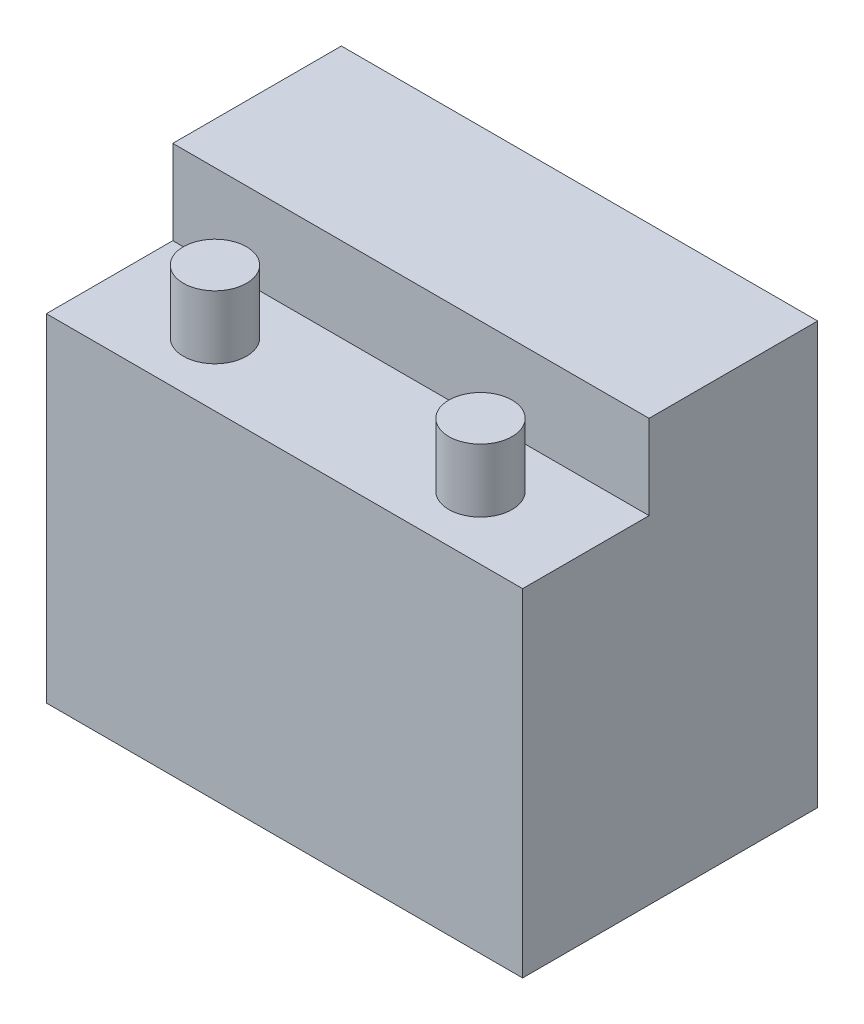
ISO-10303-21;
HEADER;
FILE_DESCRIPTION(('STEP AP214'),'2;1');
FILE_NAME('part.step','',(''),(''),'','','');
FILE_SCHEMA(('AUTOMOTIVE_DESIGN { 1 0 10303 214 1 1 1 1 }'));
ENDSEC;
DATA;
#1=APPLICATION_CONTEXT('core data for automotive mechanical design processes');
#2=APPLICATION_PROTOCOL_DEFINITION('international standard','automotive_design',2000,#1);
#3=PRODUCT_CONTEXT('',#1,'mechanical');
#4=PRODUCT('Part','Part','',(#3));
#5=PRODUCT_RELATED_PRODUCT_CATEGORY('part','',(#4));
#6=PRODUCT_DEFINITION_FORMATION('','',#4);
#7=PRODUCT_DEFINITION_CONTEXT('part definition',#1,'design');
#8=PRODUCT_DEFINITION('design','',#6,#7);
#9=PRODUCT_DEFINITION_SHAPE('','',#8);
#10=(LENGTH_UNIT() NAMED_UNIT(*) SI_UNIT(.MILLI.,.METRE.));
#11=(NAMED_UNIT(*) PLANE_ANGLE_UNIT() SI_UNIT($,.RADIAN.));
#12=(NAMED_UNIT(*) SI_UNIT($,.STERADIAN.) SOLID_ANGLE_UNIT());
#13=UNCERTAINTY_MEASURE_WITH_UNIT(LENGTH_MEASURE(1.E-05),#10,'distance_accuracy_value','');
#14=(GEOMETRIC_REPRESENTATION_CONTEXT(3) GLOBAL_UNCERTAINTY_ASSIGNED_CONTEXT((#13)) GLOBAL_UNIT_ASSIGNED_CONTEXT((#10,
#11,#12)) REPRESENTATION_CONTEXT('',''));
#15=CARTESIAN_POINT('',(0.,0.,0.));
#16=DIRECTION('',(0.,0.,1.));
#17=DIRECTION('',(1.,0.,0.));
#18=AXIS2_PLACEMENT_3D('',#15,#16,#17);
#19=CARTESIAN_POINT('',(-56.5,100.,35.));
#20=DIRECTION('',(0.,0.,-1.));
#21=DIRECTION('',(-1.,0.,0.));
#22=AXIS2_PLACEMENT_3D('',#19,#20,#21);
#23=PLANE('',#22);
#24=DIRECTION('',(1.,0.,0.));
#25=VECTOR('',#24,1.);
#26=CARTESIAN_POINT('',(56.5,80.,35.));
#27=LINE('',#26,#25);
#28=CARTESIAN_POINT('',(-56.5,80.,35.));
#29=VERTEX_POINT('',#28);
#30=CARTESIAN_POINT('',(56.5,80.,35.));
#31=VERTEX_POINT('',#30);
#32=EDGE_CURVE('E119',#29,#31,#27,.T.);
#33=ORIENTED_EDGE('',*,*,#32,.F.);
#34=DIRECTION('',(0.,-1.,0.));
#35=VECTOR('',#34,1.);
#36=CARTESIAN_POINT('',(-56.5,100.,35.));
#37=LINE('',#36,#35);
#38=CARTESIAN_POINT('',(-56.5,0.,35.));
#39=VERTEX_POINT('',#38);
#40=EDGE_CURVE('E86',#29,#39,#37,.T.);
#41=ORIENTED_EDGE('',*,*,#40,.T.);
#42=DIRECTION('',(1.,0.,0.));
#43=VECTOR('',#42,1.);
#44=CARTESIAN_POINT('',(-56.5,0.,35.));
#45=LINE('',#44,#43);
#46=CARTESIAN_POINT('',(56.5,0.,35.));
#47=VERTEX_POINT('',#46);
#48=EDGE_CURVE('E90',#39,#47,#45,.T.);
#49=ORIENTED_EDGE('',*,*,#48,.T.);
#50=DIRECTION('',(0.,-1.,0.));
#51=VECTOR('',#50,1.);
#52=CARTESIAN_POINT('',(56.5,100.,35.));
#53=LINE('',#52,#51);
#54=EDGE_CURVE('E76',#31,#47,#53,.T.);
#55=ORIENTED_EDGE('',*,*,#54,.F.);
#56=EDGE_LOOP('',(#33,#41,#49,#55));
#57=FACE_BOUND('',#56,.T.);
#58=ADVANCED_FACE('F32',(#57),#23,.F.);
#59=CARTESIAN_POINT('',(56.5,100.,35.));
#60=DIRECTION('',(-1.,0.,0.));
#61=DIRECTION('',(0.,0.,1.));
#62=AXIS2_PLACEMENT_3D('',#59,#60,#61);
#63=PLANE('',#62);
#64=DIRECTION('',(0.,0.,-1.));
#65=VECTOR('',#64,1.);
#66=CARTESIAN_POINT('',(56.5,100.,35.));
#67=LINE('',#66,#65);
#68=CARTESIAN_POINT('',(56.5,100.,5.00000000000001));
#69=VERTEX_POINT('',#68);
#70=CARTESIAN_POINT('',(56.5,100.,-35.));
#71=VERTEX_POINT('',#70);
#72=EDGE_CURVE('E95',#69,#71,#67,.T.);
#73=ORIENTED_EDGE('',*,*,#72,.F.);
#74=DIRECTION('',(0.,1.,0.));
#75=VECTOR('',#74,1.);
#76=CARTESIAN_POINT('',(56.5,80.,5.));
#77=LINE('',#76,#75);
#78=CARTESIAN_POINT('',(56.5,80.,5.));
#79=VERTEX_POINT('',#78);
#80=EDGE_CURVE('E47',#79,#69,#77,.T.);
#81=ORIENTED_EDGE('',*,*,#80,.F.);
#82=DIRECTION('',(0.,0.,-1.));
#83=VECTOR('',#82,1.);
#84=CARTESIAN_POINT('',(56.5,80.,35.));
#85=LINE('',#84,#83);
#86=EDGE_CURVE('E83',#31,#79,#85,.T.);
#87=ORIENTED_EDGE('',*,*,#86,.F.);
#88=ORIENTED_EDGE('',*,*,#54,.T.);
#89=DIRECTION('',(0.,0.,-1.));
#90=VECTOR('',#89,1.);
#91=CARTESIAN_POINT('',(56.5,0.,35.));
#92=LINE('',#91,#90);
#93=CARTESIAN_POINT('',(56.5,0.,-35.));
#94=VERTEX_POINT('',#93);
#95=EDGE_CURVE('E81',#47,#94,#92,.T.);
#96=ORIENTED_EDGE('',*,*,#95,.T.);
#97=DIRECTION('',(0.,-1.,0.));
#98=VECTOR('',#97,1.);
#99=CARTESIAN_POINT('',(56.5,100.,-35.));
#100=LINE('',#99,#98);
#101=EDGE_CURVE('E11',#71,#94,#100,.T.);
#102=ORIENTED_EDGE('',*,*,#101,.F.);
#103=EDGE_LOOP('',(#73,#81,#87,#88,#96,#102));
#104=FACE_BOUND('',#103,.T.);
#105=ADVANCED_FACE('F34',(#104),#63,.F.);
#106=CARTESIAN_POINT('',(-56.5,100.,-35.));
#107=DIRECTION('',(0.,0.,1.));
#108=DIRECTION('',(1.,0.,0.));
#109=AXIS2_PLACEMENT_3D('',#106,#107,#108);
#110=PLANE('',#109);
#111=DIRECTION('',(-1.,0.,0.));
#112=VECTOR('',#111,1.);
#113=CARTESIAN_POINT('',(-56.5,0.,-35.));
#114=LINE('',#113,#112);
#115=CARTESIAN_POINT('',(-56.5,0.,-35.));
#116=VERTEX_POINT('',#115);
#117=EDGE_CURVE('E99',#94,#116,#114,.T.);
#118=ORIENTED_EDGE('',*,*,#117,.T.);
#119=DIRECTION('',(0.,-1.,0.));
#120=VECTOR('',#119,1.);
#121=CARTESIAN_POINT('',(-56.5,100.,-35.));
#122=LINE('',#121,#120);
#123=CARTESIAN_POINT('',(-56.5,100.,-35.));
#124=VERTEX_POINT('',#123);
#125=EDGE_CURVE('E40',#124,#116,#122,.T.);
#126=ORIENTED_EDGE('',*,*,#125,.F.);
#127=DIRECTION('',(-1.,0.,0.));
#128=VECTOR('',#127,1.);
#129=CARTESIAN_POINT('',(-56.5,100.,-35.));
#130=LINE('',#129,#128);
#131=EDGE_CURVE('E56',#71,#124,#130,.T.);
#132=ORIENTED_EDGE('',*,*,#131,.F.);
#133=ORIENTED_EDGE('',*,*,#101,.T.);
#134=EDGE_LOOP('',(#118,#126,#132,#133));
#135=FACE_BOUND('',#134,.T.);
#136=ADVANCED_FACE('F115',(#135),#110,.F.);
#137=CARTESIAN_POINT('',(-56.5,100.,35.));
#138=DIRECTION('',(1.,0.,0.));
#139=DIRECTION('',(0.,0.,-1.));
#140=AXIS2_PLACEMENT_3D('',#137,#138,#139);
#141=PLANE('',#140);
#142=DIRECTION('',(0.,0.,1.));
#143=VECTOR('',#142,1.);
#144=CARTESIAN_POINT('',(-56.5,80.,35.));
#145=LINE('',#144,#143);
#146=CARTESIAN_POINT('',(-56.5,80.,5.00000000000002));
#147=VERTEX_POINT('',#146);
#148=EDGE_CURVE('E126',#147,#29,#145,.T.);
#149=ORIENTED_EDGE('',*,*,#148,.F.);
#150=DIRECTION('',(0.,1.,0.));
#151=VECTOR('',#150,1.);
#152=CARTESIAN_POINT('',(-56.5,80.,5.00000000000002));
#153=LINE('',#152,#151);
#154=CARTESIAN_POINT('',(-56.5,100.,5.00000000000002));
#155=VERTEX_POINT('',#154);
#156=EDGE_CURVE('E100',#147,#155,#153,.T.);
#157=ORIENTED_EDGE('',*,*,#156,.T.);
#158=DIRECTION('',(0.,0.,1.));
#159=VECTOR('',#158,1.);
#160=CARTESIAN_POINT('',(-56.5,100.,35.));
#161=LINE('',#160,#159);
#162=EDGE_CURVE('E87',#124,#155,#161,.T.);
#163=ORIENTED_EDGE('',*,*,#162,.F.);
#164=ORIENTED_EDGE('',*,*,#125,.T.);
#165=DIRECTION('',(0.,0.,1.));
#166=VECTOR('',#165,1.);
#167=CARTESIAN_POINT('',(-56.5,0.,35.));
#168=LINE('',#167,#166);
#169=EDGE_CURVE('E96',#116,#39,#168,.T.);
#170=ORIENTED_EDGE('',*,*,#169,.T.);
#171=ORIENTED_EDGE('',*,*,#40,.F.);
#172=EDGE_LOOP('',(#149,#157,#163,#164,#170,#171));
#173=FACE_BOUND('',#172,.T.);
#174=ADVANCED_FACE('F113',(#173),#141,.F.);
#175=CARTESIAN_POINT('',(0.,100.,0.));
#176=DIRECTION('',(0.,-1.,0.));
#177=DIRECTION('',(0.,0.,-1.));
#178=AXIS2_PLACEMENT_3D('',#175,#176,#177);
#179=PLANE('',#178);
#180=ORIENTED_EDGE('',*,*,#162,.T.);
#181=DIRECTION('',(-1.,0.,0.));
#182=VECTOR('',#181,1.);
#183=CARTESIAN_POINT('',(56.5,100.,5.));
#184=LINE('',#183,#182);
#185=EDGE_CURVE('E121',#69,#155,#184,.T.);
#186=ORIENTED_EDGE('',*,*,#185,.F.);
#187=ORIENTED_EDGE('',*,*,#72,.T.);
#188=ORIENTED_EDGE('',*,*,#131,.T.);
#189=EDGE_LOOP('',(#180,#186,#187,#188));
#190=FACE_BOUND('',#189,.T.);
#191=ADVANCED_FACE('F170',(#190),#179,.F.);
#192=CARTESIAN_POINT('',(0.,0.,0.));
#193=DIRECTION('',(0.,-1.,0.));
#194=DIRECTION('',(0.,0.,-1.));
#195=AXIS2_PLACEMENT_3D('',#192,#193,#194);
#196=PLANE('',#195);
#197=ORIENTED_EDGE('',*,*,#95,.F.);
#198=ORIENTED_EDGE('',*,*,#48,.F.);
#199=ORIENTED_EDGE('',*,*,#169,.F.);
#200=ORIENTED_EDGE('',*,*,#117,.F.);
#201=EDGE_LOOP('',(#197,#198,#199,#200));
#202=FACE_BOUND('',#201,.T.);
#203=ADVANCED_FACE('F98',(#202),#196,.T.);
#204=CARTESIAN_POINT('',(56.5,80.,5.));
#205=DIRECTION('',(0.,0.,-1.));
#206=DIRECTION('',(-1.,0.,0.));
#207=AXIS2_PLACEMENT_3D('',#204,#205,#206);
#208=PLANE('',#207);
#209=ORIENTED_EDGE('',*,*,#185,.T.);
#210=ORIENTED_EDGE('',*,*,#156,.F.);
#211=DIRECTION('',(-1.,0.,0.));
#212=VECTOR('',#211,1.);
#213=CARTESIAN_POINT('',(56.5,80.,5.));
#214=LINE('',#213,#212);
#215=EDGE_CURVE('E129',#79,#147,#214,.T.);
#216=ORIENTED_EDGE('',*,*,#215,.F.);
#217=ORIENTED_EDGE('',*,*,#80,.T.);
#218=EDGE_LOOP('',(#209,#210,#216,#217));
#219=FACE_BOUND('',#218,.T.);
#220=ADVANCED_FACE('F158',(#219),#208,.F.);
#221=CARTESIAN_POINT('',(0.,80.,0.));
#222=DIRECTION('',(0.,1.,0.));
#223=DIRECTION('',(0.,0.,1.));
#224=AXIS2_PLACEMENT_3D('',#221,#222,#223);
#225=PLANE('',#224);
#226=CARTESIAN_POINT('',(31.5,80.,20.));
#227=DIRECTION('',(0.,1.,0.));
#228=DIRECTION('',(0.,0.,1.));
#229=AXIS2_PLACEMENT_3D('',#226,#227,#228);
#230=CIRCLE('',#229,7.5);
#231=CARTESIAN_POINT('',(31.5,80.,27.5));
#232=VERTEX_POINT('',#231);
#233=EDGE_CURVE('E139',#232,#232,#230,.T.);
#234=ORIENTED_EDGE('',*,*,#233,.F.);
#235=EDGE_LOOP('',(#234));
#236=FACE_BOUND('',#235,.T.);
#237=CARTESIAN_POINT('',(-31.5,80.,20.));
#238=DIRECTION('',(0.,1.,0.));
#239=DIRECTION('',(0.,0.,1.));
#240=AXIS2_PLACEMENT_3D('',#237,#238,#239);
#241=CIRCLE('',#240,7.5);
#242=CARTESIAN_POINT('',(-31.5,80.,27.5));
#243=VERTEX_POINT('',#242);
#244=EDGE_CURVE('E133',#243,#243,#241,.T.);
#245=ORIENTED_EDGE('',*,*,#244,.F.);
#246=EDGE_LOOP('',(#245));
#247=FACE_BOUND('',#246,.T.);
#248=ORIENTED_EDGE('',*,*,#86,.T.);
#249=ORIENTED_EDGE('',*,*,#215,.T.);
#250=ORIENTED_EDGE('',*,*,#148,.T.);
#251=ORIENTED_EDGE('',*,*,#32,.T.);
#252=EDGE_LOOP('',(#248,#249,#250,#251));
#253=FACE_BOUND('',#252,.T.);
#254=ADVANCED_FACE('F154',(#236,#247,#253),#225,.T.);
#255=CARTESIAN_POINT('',(-31.5,95.,20.));
#256=DIRECTION('',(0.,-1.,0.));
#257=DIRECTION('',(0.,0.,-1.));
#258=AXIS2_PLACEMENT_3D('',#255,#256,#257);
#259=CYLINDRICAL_SURFACE('',#258,7.5);
#260=CARTESIAN_POINT('',(-31.5,95.,20.));
#261=DIRECTION('',(0.,1.,0.));
#262=DIRECTION('',(0.,0.,1.));
#263=AXIS2_PLACEMENT_3D('',#260,#261,#262);
#264=CIRCLE('',#263,7.5);
#265=CARTESIAN_POINT('',(-31.5,95.,27.5));
#266=VERTEX_POINT('',#265);
#267=EDGE_CURVE('E123',#266,#266,#264,.T.);
#268=ORIENTED_EDGE('',*,*,#267,.F.);
#269=EDGE_LOOP('',(#268));
#270=FACE_BOUND('',#269,.T.);
#271=ORIENTED_EDGE('',*,*,#244,.T.);
#272=EDGE_LOOP('',(#271));
#273=FACE_BOUND('',#272,.T.);
#274=ADVANCED_FACE('F157',(#270,#273),#259,.T.);
#275=CARTESIAN_POINT('',(-31.5,95.,20.));
#276=DIRECTION('',(0.,1.,0.));
#277=DIRECTION('',(0.,0.,1.));
#278=AXIS2_PLACEMENT_3D('',#275,#276,#277);
#279=PLANE('',#278);
#280=ORIENTED_EDGE('',*,*,#267,.T.);
#281=EDGE_LOOP('',(#280));
#282=FACE_BOUND('',#281,.T.);
#283=ADVANCED_FACE('F150',(#282),#279,.T.);
#284=CARTESIAN_POINT('',(31.5,95.,20.));
#285=DIRECTION('',(0.,-1.,0.));
#286=DIRECTION('',(0.,0.,-1.));
#287=AXIS2_PLACEMENT_3D('',#284,#285,#286);
#288=CYLINDRICAL_SURFACE('',#287,7.5);
#289=CARTESIAN_POINT('',(31.5,95.,20.));
#290=DIRECTION('',(0.,1.,0.));
#291=DIRECTION('',(0.,0.,1.));
#292=AXIS2_PLACEMENT_3D('',#289,#290,#291);
#293=CIRCLE('',#292,7.5);
#294=CARTESIAN_POINT('',(31.5,95.,27.5));
#295=VERTEX_POINT('',#294);
#296=EDGE_CURVE('E136',#295,#295,#293,.T.);
#297=ORIENTED_EDGE('',*,*,#296,.F.);
#298=EDGE_LOOP('',(#297));
#299=FACE_BOUND('',#298,.T.);
#300=ORIENTED_EDGE('',*,*,#233,.T.);
#301=EDGE_LOOP('',(#300));
#302=FACE_BOUND('',#301,.T.);
#303=ADVANCED_FACE('F147',(#299,#302),#288,.T.);
#304=CARTESIAN_POINT('',(31.5,95.,20.));
#305=DIRECTION('',(0.,1.,0.));
#306=DIRECTION('',(0.,0.,1.));
#307=AXIS2_PLACEMENT_3D('',#304,#305,#306);
#308=PLANE('',#307);
#309=ORIENTED_EDGE('',*,*,#296,.T.);
#310=EDGE_LOOP('',(#309));
#311=FACE_BOUND('',#310,.T.);
#312=ADVANCED_FACE('F145',(#311),#308,.T.);
#313=CLOSED_SHELL('',(#58,#105,#136,#174,#191,#203,#220,#254,#274,#283,#303,#312));
#314=MANIFOLD_SOLID_BREP('B2',#313);
#315=ADVANCED_BREP_SHAPE_REPRESENTATION('',(#18,#314),#14);
#316=SHAPE_DEFINITION_REPRESENTATION(#9,#315);
ENDSEC;
END-ISO-10303-21;
